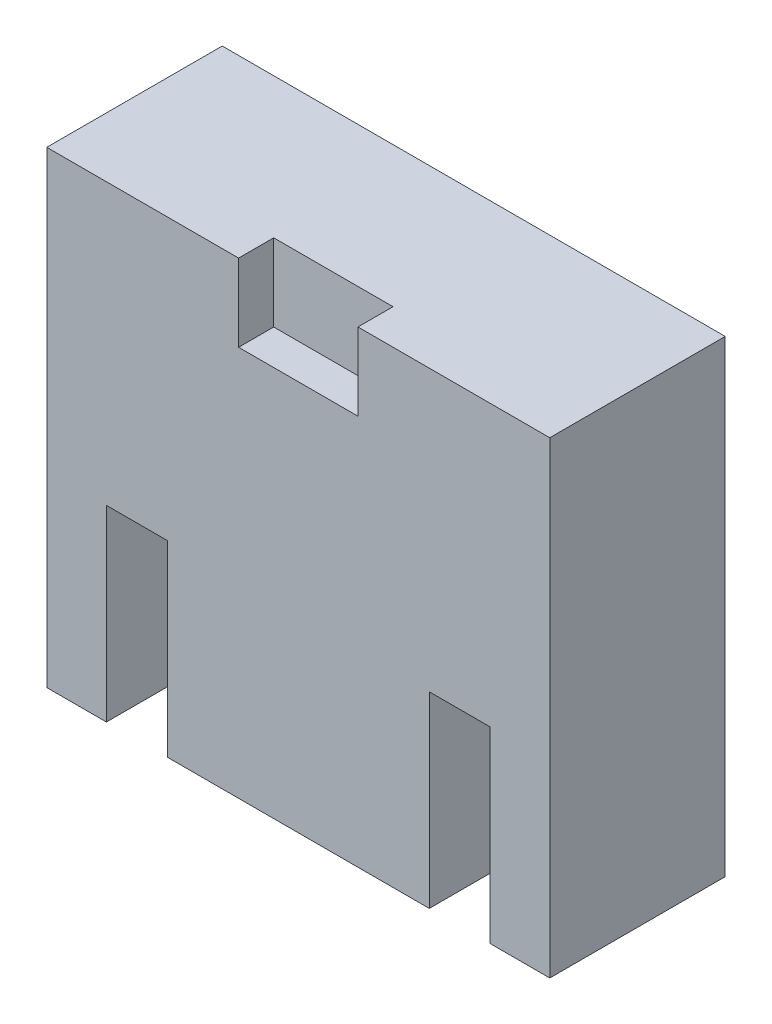
ISO-10303-21;
HEADER;
FILE_DESCRIPTION(('STEP AP214'),'2;1');
FILE_NAME('part.step','',(''),(''),'','','');
FILE_SCHEMA(('AUTOMOTIVE_DESIGN { 1 0 10303 214 1 1 1 1 }'));
ENDSEC;
DATA;
#1=APPLICATION_CONTEXT('core data for automotive mechanical design processes');
#2=APPLICATION_PROTOCOL_DEFINITION('international standard','automotive_design',2000,#1);
#3=PRODUCT_CONTEXT('',#1,'mechanical');
#4=PRODUCT('Part','Part','',(#3));
#5=PRODUCT_RELATED_PRODUCT_CATEGORY('part','',(#4));
#6=PRODUCT_DEFINITION_FORMATION('','',#4);
#7=PRODUCT_DEFINITION_CONTEXT('part definition',#1,'design');
#8=PRODUCT_DEFINITION('design','',#6,#7);
#9=PRODUCT_DEFINITION_SHAPE('','',#8);
#10=(LENGTH_UNIT() NAMED_UNIT(*) SI_UNIT(.MILLI.,.METRE.));
#11=(NAMED_UNIT(*) PLANE_ANGLE_UNIT() SI_UNIT($,.RADIAN.));
#12=(NAMED_UNIT(*) SI_UNIT($,.STERADIAN.) SOLID_ANGLE_UNIT());
#13=UNCERTAINTY_MEASURE_WITH_UNIT(LENGTH_MEASURE(1.E-05),#10,'distance_accuracy_value','');
#14=(GEOMETRIC_REPRESENTATION_CONTEXT(3) GLOBAL_UNCERTAINTY_ASSIGNED_CONTEXT((#13)) GLOBAL_UNIT_ASSIGNED_CONTEXT((#10,
#11,#12)) REPRESENTATION_CONTEXT('',''));
#15=CARTESIAN_POINT('',(0.,0.,0.));
#16=DIRECTION('',(0.,0.,1.));
#17=DIRECTION('',(1.,0.,0.));
#18=AXIS2_PLACEMENT_3D('',#15,#16,#17);
#19=CARTESIAN_POINT('',(-19.7511961722488,-18.7224880382775,15.));
#20=DIRECTION('',(0.,1.,0.));
#21=DIRECTION('',(0.,0.,1.));
#22=AXIS2_PLACEMENT_3D('',#19,#20,#21);
#23=PLANE('',#22);
#24=DIRECTION('',(0.,0.,1.));
#25=VECTOR('',#24,1.);
#26=CARTESIAN_POINT('',(-14.6511961722488,-18.7224880382775,5.));
#27=LINE('',#26,#25);
#28=CARTESIAN_POINT('',(-14.6511961722488,-18.7224880382775,5.));
#29=VERTEX_POINT('',#28);
#30=CARTESIAN_POINT('',(-14.6511961722488,-18.7224880382775,15.));
#31=VERTEX_POINT('',#30);
#32=EDGE_CURVE('E245',#29,#31,#27,.T.);
#33=ORIENTED_EDGE('',*,*,#32,.T.);
#34=DIRECTION('',(1.,0.,0.));
#35=VECTOR('',#34,1.);
#36=CARTESIAN_POINT('',(-19.7511961722488,-18.7224880382775,15.));
#37=LINE('',#36,#35);
#38=CARTESIAN_POINT('',(-19.7511961722488,-18.7224880382775,15.));
#39=VERTEX_POINT('',#38);
#40=EDGE_CURVE('E272',#39,#31,#37,.T.);
#41=ORIENTED_EDGE('',*,*,#40,.F.);
#42=DIRECTION('',(0.,0.,-1.));
#43=VECTOR('',#42,1.);
#44=CARTESIAN_POINT('',(-19.7511961722488,-18.7224880382775,15.));
#45=LINE('',#44,#43);
#46=CARTESIAN_POINT('',(-19.7511961722488,-18.7224880382775,0.));
#47=VERTEX_POINT('',#46);
#48=EDGE_CURVE('E11',#39,#47,#45,.T.);
#49=ORIENTED_EDGE('',*,*,#48,.T.);
#50=DIRECTION('',(1.,0.,0.));
#51=VECTOR('',#50,1.);
#52=CARTESIAN_POINT('',(-19.7511961722488,-18.7224880382775,0.));
#53=LINE('',#52,#51);
#54=CARTESIAN_POINT('',(23.2488038277512,-18.7224880382775,0.));
#55=VERTEX_POINT('',#54);
#56=EDGE_CURVE('E288',#47,#55,#53,.T.);
#57=ORIENTED_EDGE('',*,*,#56,.T.);
#58=DIRECTION('',(0.,0.,-1.));
#59=VECTOR('',#58,1.);
#60=CARTESIAN_POINT('',(23.2488038277512,-18.7224880382775,15.));
#61=LINE('',#60,#59);
#62=CARTESIAN_POINT('',(23.2488038277512,-18.7224880382775,15.));
#63=VERTEX_POINT('',#62);
#64=EDGE_CURVE('E48',#63,#55,#61,.T.);
#65=ORIENTED_EDGE('',*,*,#64,.F.);
#66=CARTESIAN_POINT('',(18.1488038277512,-18.7224880382775,15.));
#67=VERTEX_POINT('',#66);
#68=EDGE_CURVE('E270',#67,#63,#37,.T.);
#69=ORIENTED_EDGE('',*,*,#68,.F.);
#70=DIRECTION('',(0.,0.,1.));
#71=VECTOR('',#70,1.);
#72=CARTESIAN_POINT('',(18.1488038277512,-18.7224880382775,5.));
#73=LINE('',#72,#71);
#74=CARTESIAN_POINT('',(18.1488038277512,-18.7224880382775,5.));
#75=VERTEX_POINT('',#74);
#76=EDGE_CURVE('E55',#75,#67,#73,.T.);
#77=ORIENTED_EDGE('',*,*,#76,.F.);
#78=DIRECTION('',(1.,0.,0.));
#79=VECTOR('',#78,1.);
#80=CARTESIAN_POINT('',(0.,-18.7224880382775,5.));
#81=LINE('',#80,#79);
#82=CARTESIAN_POINT('',(12.9488038277512,-18.7224880382775,5.));
#83=VERTEX_POINT('',#82);
#84=EDGE_CURVE('E186',#83,#75,#81,.T.);
#85=ORIENTED_EDGE('',*,*,#84,.F.);
#86=DIRECTION('',(0.,0.,1.));
#87=VECTOR('',#86,1.);
#88=CARTESIAN_POINT('',(12.9488038277512,-18.7224880382775,5.));
#89=LINE('',#88,#87);
#90=CARTESIAN_POINT('',(12.9488038277512,-18.7224880382775,15.));
#91=VERTEX_POINT('',#90);
#92=EDGE_CURVE('E212',#83,#91,#89,.T.);
#93=ORIENTED_EDGE('',*,*,#92,.T.);
#94=CARTESIAN_POINT('',(-9.4511961722488,-18.7224880382775,15.));
#95=VERTEX_POINT('',#94);
#96=EDGE_CURVE('E176',#95,#91,#37,.T.);
#97=ORIENTED_EDGE('',*,*,#96,.F.);
#98=DIRECTION('',(0.,0.,1.));
#99=VECTOR('',#98,1.);
#100=CARTESIAN_POINT('',(-9.4511961722488,-18.7224880382775,5.));
#101=LINE('',#100,#99);
#102=CARTESIAN_POINT('',(-9.4511961722488,-18.7224880382775,5.));
#103=VERTEX_POINT('',#102);
#104=EDGE_CURVE('E63',#103,#95,#101,.T.);
#105=ORIENTED_EDGE('',*,*,#104,.F.);
#106=DIRECTION('',(1.,0.,0.));
#107=VECTOR('',#106,1.);
#108=CARTESIAN_POINT('',(0.,-18.7224880382775,5.));
#109=LINE('',#108,#107);
#110=EDGE_CURVE('E162',#29,#103,#109,.T.);
#111=ORIENTED_EDGE('',*,*,#110,.F.);
#112=EDGE_LOOP('',(#33,#41,#49,#57,#65,#69,#77,#85,#93,#97,#105,#111));
#113=FACE_BOUND('',#112,.T.);
#114=ADVANCED_FACE('F39',(#113),#23,.F.);
#115=CARTESIAN_POINT('',(0.,0.,15.));
#116=DIRECTION('',(0.,0.,1.));
#117=DIRECTION('',(1.,0.,0.));
#118=AXIS2_PLACEMENT_3D('',#115,#116,#117);
#119=PLANE('',#118);
#120=ORIENTED_EDGE('',*,*,#40,.T.);
#121=DIRECTION('',(0.,1.,0.));
#122=VECTOR('',#121,1.);
#123=CARTESIAN_POINT('',(-14.6511961722488,0.,15.));
#124=LINE('',#123,#122);
#125=CARTESIAN_POINT('',(-14.6511961722488,-2.68154776159317,15.));
#126=VERTEX_POINT('',#125);
#127=EDGE_CURVE('E171',#31,#126,#124,.T.);
#128=ORIENTED_EDGE('',*,*,#127,.T.);
#129=DIRECTION('',(1.,0.,0.));
#130=VECTOR('',#129,1.);
#131=CARTESIAN_POINT('',(0.,-2.68154776159317,15.));
#132=LINE('',#131,#130);
#133=CARTESIAN_POINT('',(-9.4511961722488,-2.68154776159317,15.));
#134=VERTEX_POINT('',#133);
#135=EDGE_CURVE('E341',#126,#134,#132,.T.);
#136=ORIENTED_EDGE('',*,*,#135,.T.);
#137=DIRECTION('',(0.,1.,0.));
#138=VECTOR('',#137,1.);
#139=CARTESIAN_POINT('',(-9.4511961722488,0.,15.));
#140=LINE('',#139,#138);
#141=EDGE_CURVE('E215',#95,#134,#140,.T.);
#142=ORIENTED_EDGE('',*,*,#141,.F.);
#143=ORIENTED_EDGE('',*,*,#96,.T.);
#144=DIRECTION('',(0.,1.,0.));
#145=VECTOR('',#144,1.);
#146=CARTESIAN_POINT('',(12.9488038277512,0.,15.));
#147=LINE('',#146,#145);
#148=CARTESIAN_POINT('',(12.9488038277512,-2.68154776159316,15.));
#149=VERTEX_POINT('',#148);
#150=EDGE_CURVE('E191',#91,#149,#147,.T.);
#151=ORIENTED_EDGE('',*,*,#150,.T.);
#152=DIRECTION('',(-1.,0.,0.));
#153=VECTOR('',#152,1.);
#154=CARTESIAN_POINT('',(0.,-2.68154776159316,15.));
#155=LINE('',#154,#153);
#156=CARTESIAN_POINT('',(18.1488038277512,-2.68154776159316,15.));
#157=VERTEX_POINT('',#156);
#158=EDGE_CURVE('E205',#157,#149,#155,.T.);
#159=ORIENTED_EDGE('',*,*,#158,.F.);
#160=DIRECTION('',(0.,1.,0.));
#161=VECTOR('',#160,1.);
#162=CARTESIAN_POINT('',(18.1488038277512,0.,15.));
#163=LINE('',#162,#161);
#164=EDGE_CURVE('E202',#67,#157,#163,.T.);
#165=ORIENTED_EDGE('',*,*,#164,.F.);
#166=ORIENTED_EDGE('',*,*,#68,.T.);
#167=DIRECTION('',(0.,1.,0.));
#168=VECTOR('',#167,1.);
#169=CARTESIAN_POINT('',(23.2488038277512,21.2775119617225,15.));
#170=LINE('',#169,#168);
#171=CARTESIAN_POINT('',(23.2488038277512,21.2775119617225,15.));
#172=VERTEX_POINT('',#171);
#173=EDGE_CURVE('E276',#63,#172,#170,.T.);
#174=ORIENTED_EDGE('',*,*,#173,.T.);
#175=DIRECTION('',(-1.,0.,0.));
#176=VECTOR('',#175,1.);
#177=CARTESIAN_POINT('',(-19.7511961722488,21.2775119617225,15.));
#178=LINE('',#177,#176);
#179=CARTESIAN_POINT('',(6.84880382775119,21.2775119617225,15.));
#180=VERTEX_POINT('',#179);
#181=EDGE_CURVE('E280',#172,#180,#178,.T.);
#182=ORIENTED_EDGE('',*,*,#181,.T.);
#183=DIRECTION('',(0.,-1.,0.));
#184=VECTOR('',#183,1.);
#185=CARTESIAN_POINT('',(6.84880382775119,0.,15.));
#186=LINE('',#185,#184);
#187=CARTESIAN_POINT('',(6.84880382775119,14.6721788333005,15.));
#188=VERTEX_POINT('',#187);
#189=EDGE_CURVE('E229',#180,#188,#186,.T.);
#190=ORIENTED_EDGE('',*,*,#189,.T.);
#191=DIRECTION('',(1.,0.,0.));
#192=VECTOR('',#191,1.);
#193=CARTESIAN_POINT('',(0.,14.6721788333005,15.));
#194=LINE('',#193,#192);
#195=CARTESIAN_POINT('',(-3.35119617224881,14.6721788333005,15.));
#196=VERTEX_POINT('',#195);
#197=EDGE_CURVE('E244',#196,#188,#194,.T.);
#198=ORIENTED_EDGE('',*,*,#197,.F.);
#199=DIRECTION('',(0.,-1.,0.));
#200=VECTOR('',#199,1.);
#201=CARTESIAN_POINT('',(-3.35119617224881,0.,15.));
#202=LINE('',#201,#200);
#203=CARTESIAN_POINT('',(-3.35119617224881,21.2775119617225,15.));
#204=VERTEX_POINT('',#203);
#205=EDGE_CURVE('E241',#204,#196,#202,.T.);
#206=ORIENTED_EDGE('',*,*,#205,.F.);
#207=CARTESIAN_POINT('',(-19.7511961722488,21.2775119617225,15.));
#208=VERTEX_POINT('',#207);
#209=EDGE_CURVE('E279',#204,#208,#178,.T.);
#210=ORIENTED_EDGE('',*,*,#209,.T.);
#211=DIRECTION('',(0.,-1.,0.));
#212=VECTOR('',#211,1.);
#213=CARTESIAN_POINT('',(-19.7511961722488,21.2775119617225,15.));
#214=LINE('',#213,#212);
#215=EDGE_CURVE('E266',#208,#39,#214,.T.);
#216=ORIENTED_EDGE('',*,*,#215,.T.);
#217=EDGE_LOOP('',(#120,#128,#136,#142,#143,#151,#159,#165,#166,#174,#182,#190,#198,#206,#210,#216));
#218=FACE_BOUND('',#217,.T.);
#219=ADVANCED_FACE('F324',(#218),#119,.T.);
#220=CARTESIAN_POINT('',(-19.7511961722488,21.2775119617225,15.));
#221=DIRECTION('',(1.,0.,0.));
#222=DIRECTION('',(0.,1.,0.));
#223=AXIS2_PLACEMENT_3D('',#220,#221,#222);
#224=PLANE('',#223);
#225=DIRECTION('',(0.,-1.,0.));
#226=VECTOR('',#225,1.);
#227=CARTESIAN_POINT('',(-19.7511961722488,21.2775119617225,0.));
#228=LINE('',#227,#226);
#229=CARTESIAN_POINT('',(-19.7511961722488,21.2775119617225,0.));
#230=VERTEX_POINT('',#229);
#231=EDGE_CURVE('E255',#230,#47,#228,.T.);
#232=ORIENTED_EDGE('',*,*,#231,.T.);
#233=ORIENTED_EDGE('',*,*,#48,.F.);
#234=ORIENTED_EDGE('',*,*,#215,.F.);
#235=DIRECTION('',(0.,0.,-1.));
#236=VECTOR('',#235,1.);
#237=CARTESIAN_POINT('',(-19.7511961722488,21.2775119617225,15.));
#238=LINE('',#237,#236);
#239=EDGE_CURVE('E284',#208,#230,#238,.T.);
#240=ORIENTED_EDGE('',*,*,#239,.T.);
#241=EDGE_LOOP('',(#232,#233,#234,#240));
#242=FACE_BOUND('',#241,.T.);
#243=ADVANCED_FACE('F41',(#242),#224,.F.);
#244=CARTESIAN_POINT('',(23.2488038277512,21.2775119617225,15.));
#245=DIRECTION('',(-1.,0.,0.));
#246=DIRECTION('',(0.,-1.,0.));
#247=AXIS2_PLACEMENT_3D('',#244,#245,#246);
#248=PLANE('',#247);
#249=DIRECTION('',(0.,1.,0.));
#250=VECTOR('',#249,1.);
#251=CARTESIAN_POINT('',(23.2488038277512,21.2775119617225,0.));
#252=LINE('',#251,#250);
#253=CARTESIAN_POINT('',(23.2488038277512,21.2775119617225,0.));
#254=VERTEX_POINT('',#253);
#255=EDGE_CURVE('E291',#55,#254,#252,.T.);
#256=ORIENTED_EDGE('',*,*,#255,.T.);
#257=DIRECTION('',(0.,0.,-1.));
#258=VECTOR('',#257,1.);
#259=CARTESIAN_POINT('',(23.2488038277512,21.2775119617225,15.));
#260=LINE('',#259,#258);
#261=EDGE_CURVE('E299',#172,#254,#260,.T.);
#262=ORIENTED_EDGE('',*,*,#261,.F.);
#263=ORIENTED_EDGE('',*,*,#173,.F.);
#264=ORIENTED_EDGE('',*,*,#64,.T.);
#265=EDGE_LOOP('',(#256,#262,#263,#264));
#266=FACE_BOUND('',#265,.T.);
#267=ADVANCED_FACE('F308',(#266),#248,.F.);
#268=CARTESIAN_POINT('',(-19.7511961722488,21.2775119617225,15.));
#269=DIRECTION('',(0.,-1.,0.));
#270=DIRECTION('',(0.,0.,-1.));
#271=AXIS2_PLACEMENT_3D('',#268,#269,#270);
#272=PLANE('',#271);
#273=ORIENTED_EDGE('',*,*,#209,.F.);
#274=DIRECTION('',(0.,0.,1.));
#275=VECTOR('',#274,1.);
#276=CARTESIAN_POINT('',(-3.35119617224881,21.2775119617225,12.));
#277=LINE('',#276,#275);
#278=CARTESIAN_POINT('',(-3.35119617224881,21.2775119617225,12.));
#279=VERTEX_POINT('',#278);
#280=EDGE_CURVE('E252',#279,#204,#277,.T.);
#281=ORIENTED_EDGE('',*,*,#280,.F.);
#282=DIRECTION('',(-1.,0.,0.));
#283=VECTOR('',#282,1.);
#284=CARTESIAN_POINT('',(0.,21.2775119617225,12.));
#285=LINE('',#284,#283);
#286=CARTESIAN_POINT('',(6.84880382775119,21.2775119617225,12.));
#287=VERTEX_POINT('',#286);
#288=EDGE_CURVE('E236',#287,#279,#285,.T.);
#289=ORIENTED_EDGE('',*,*,#288,.F.);
#290=DIRECTION('',(0.,0.,1.));
#291=VECTOR('',#290,1.);
#292=CARTESIAN_POINT('',(6.84880382775119,21.2775119617225,12.));
#293=LINE('',#292,#291);
#294=EDGE_CURVE('E256',#287,#180,#293,.T.);
#295=ORIENTED_EDGE('',*,*,#294,.T.);
#296=ORIENTED_EDGE('',*,*,#181,.F.);
#297=ORIENTED_EDGE('',*,*,#261,.T.);
#298=DIRECTION('',(-1.,0.,0.));
#299=VECTOR('',#298,1.);
#300=CARTESIAN_POINT('',(-19.7511961722488,21.2775119617225,0.));
#301=LINE('',#300,#299);
#302=EDGE_CURVE('E271',#254,#230,#301,.T.);
#303=ORIENTED_EDGE('',*,*,#302,.T.);
#304=ORIENTED_EDGE('',*,*,#239,.F.);
#305=EDGE_LOOP('',(#273,#281,#289,#295,#296,#297,#303,#304));
#306=FACE_BOUND('',#305,.T.);
#307=ADVANCED_FACE('F318',(#306),#272,.F.);
#308=CARTESIAN_POINT('',(0.,0.,0.));
#309=DIRECTION('',(0.,0.,1.));
#310=DIRECTION('',(1.,0.,0.));
#311=AXIS2_PLACEMENT_3D('',#308,#309,#310);
#312=PLANE('',#311);
#313=ORIENTED_EDGE('',*,*,#231,.F.);
#314=ORIENTED_EDGE('',*,*,#302,.F.);
#315=ORIENTED_EDGE('',*,*,#255,.F.);
#316=ORIENTED_EDGE('',*,*,#56,.F.);
#317=EDGE_LOOP('',(#313,#314,#315,#316));
#318=FACE_BOUND('',#317,.T.);
#319=ADVANCED_FACE('F314',(#318),#312,.F.);
#320=CARTESIAN_POINT('',(-3.35119617224881,0.,12.));
#321=DIRECTION('',(-1.,0.,0.));
#322=DIRECTION('',(0.,-1.,0.));
#323=AXIS2_PLACEMENT_3D('',#320,#321,#322);
#324=PLANE('',#323);
#325=ORIENTED_EDGE('',*,*,#205,.T.);
#326=DIRECTION('',(0.,0.,1.));
#327=VECTOR('',#326,1.);
#328=CARTESIAN_POINT('',(-3.35119617224881,14.6721788333005,12.));
#329=LINE('',#328,#327);
#330=CARTESIAN_POINT('',(-3.35119617224881,14.6721788333005,12.));
#331=VERTEX_POINT('',#330);
#332=EDGE_CURVE('E240',#331,#196,#329,.T.);
#333=ORIENTED_EDGE('',*,*,#332,.F.);
#334=DIRECTION('',(0.,-1.,0.));
#335=VECTOR('',#334,1.);
#336=CARTESIAN_POINT('',(-3.35119617224881,0.,12.));
#337=LINE('',#336,#335);
#338=EDGE_CURVE('E224',#279,#331,#337,.T.);
#339=ORIENTED_EDGE('',*,*,#338,.F.);
#340=ORIENTED_EDGE('',*,*,#280,.T.);
#341=EDGE_LOOP('',(#325,#333,#339,#340));
#342=FACE_BOUND('',#341,.T.);
#343=ADVANCED_FACE('F374',(#342),#324,.F.);
#344=CARTESIAN_POINT('',(6.84880382775119,0.,12.));
#345=DIRECTION('',(-1.,0.,0.));
#346=DIRECTION('',(0.,-1.,0.));
#347=AXIS2_PLACEMENT_3D('',#344,#345,#346);
#348=PLANE('',#347);
#349=ORIENTED_EDGE('',*,*,#189,.F.);
#350=ORIENTED_EDGE('',*,*,#294,.F.);
#351=DIRECTION('',(0.,-1.,0.));
#352=VECTOR('',#351,1.);
#353=CARTESIAN_POINT('',(6.84880382775119,0.,12.));
#354=LINE('',#353,#352);
#355=CARTESIAN_POINT('',(6.84880382775119,14.6721788333005,12.));
#356=VERTEX_POINT('',#355);
#357=EDGE_CURVE('E233',#287,#356,#354,.T.);
#358=ORIENTED_EDGE('',*,*,#357,.T.);
#359=DIRECTION('',(0.,0.,1.));
#360=VECTOR('',#359,1.);
#361=CARTESIAN_POINT('',(6.84880382775119,14.6721788333005,12.));
#362=LINE('',#361,#360);
#363=EDGE_CURVE('E260',#356,#188,#362,.T.);
#364=ORIENTED_EDGE('',*,*,#363,.T.);
#365=EDGE_LOOP('',(#349,#350,#358,#364));
#366=FACE_BOUND('',#365,.T.);
#367=ADVANCED_FACE('F378',(#366),#348,.T.);
#368=CARTESIAN_POINT('',(0.,14.6721788333005,12.));
#369=DIRECTION('',(0.,-1.,0.));
#370=DIRECTION('',(1.,0.,0.));
#371=AXIS2_PLACEMENT_3D('',#368,#369,#370);
#372=PLANE('',#371);
#373=ORIENTED_EDGE('',*,*,#197,.T.);
#374=ORIENTED_EDGE('',*,*,#363,.F.);
#375=DIRECTION('',(1.,0.,0.));
#376=VECTOR('',#375,1.);
#377=CARTESIAN_POINT('',(0.,14.6721788333005,12.));
#378=LINE('',#377,#376);
#379=EDGE_CURVE('E228',#331,#356,#378,.T.);
#380=ORIENTED_EDGE('',*,*,#379,.F.);
#381=ORIENTED_EDGE('',*,*,#332,.T.);
#382=EDGE_LOOP('',(#373,#374,#380,#381));
#383=FACE_BOUND('',#382,.T.);
#384=ADVANCED_FACE('F380',(#383),#372,.F.);
#385=CARTESIAN_POINT('',(0.,0.,12.));
#386=DIRECTION('',(0.,0.,1.));
#387=DIRECTION('',(1.,0.,0.));
#388=AXIS2_PLACEMENT_3D('',#385,#386,#387);
#389=PLANE('',#388);
#390=ORIENTED_EDGE('',*,*,#338,.T.);
#391=ORIENTED_EDGE('',*,*,#379,.T.);
#392=ORIENTED_EDGE('',*,*,#357,.F.);
#393=ORIENTED_EDGE('',*,*,#288,.T.);
#394=EDGE_LOOP('',(#390,#391,#392,#393));
#395=FACE_BOUND('',#394,.T.);
#396=ADVANCED_FACE('F383',(#395),#389,.T.);
#397=CARTESIAN_POINT('',(12.9488038277512,0.,5.));
#398=DIRECTION('',(1.,0.,0.));
#399=DIRECTION('',(0.,1.,0.));
#400=AXIS2_PLACEMENT_3D('',#397,#398,#399);
#401=PLANE('',#400);
#402=ORIENTED_EDGE('',*,*,#150,.F.);
#403=ORIENTED_EDGE('',*,*,#92,.F.);
#404=DIRECTION('',(0.,1.,0.));
#405=VECTOR('',#404,1.);
#406=CARTESIAN_POINT('',(12.9488038277512,0.,5.));
#407=LINE('',#406,#405);
#408=CARTESIAN_POINT('',(12.9488038277512,-2.68154776159316,5.));
#409=VERTEX_POINT('',#408);
#410=EDGE_CURVE('E199',#83,#409,#407,.T.);
#411=ORIENTED_EDGE('',*,*,#410,.T.);
#412=DIRECTION('',(0.,0.,1.));
#413=VECTOR('',#412,1.);
#414=CARTESIAN_POINT('',(12.9488038277512,-2.68154776159316,5.));
#415=LINE('',#414,#413);
#416=EDGE_CURVE('E216',#409,#149,#415,.T.);
#417=ORIENTED_EDGE('',*,*,#416,.T.);
#418=EDGE_LOOP('',(#402,#403,#411,#417));
#419=FACE_BOUND('',#418,.T.);
#420=ADVANCED_FACE('F390',(#419),#401,.T.);
#421=CARTESIAN_POINT('',(0.,-2.68154776159316,5.));
#422=DIRECTION('',(0.,1.,0.));
#423=DIRECTION('',(0.,0.,1.));
#424=AXIS2_PLACEMENT_3D('',#421,#422,#423);
#425=PLANE('',#424);
#426=ORIENTED_EDGE('',*,*,#158,.T.);
#427=ORIENTED_EDGE('',*,*,#416,.F.);
#428=DIRECTION('',(-1.,0.,0.));
#429=VECTOR('',#428,1.);
#430=CARTESIAN_POINT('',(0.,-2.68154776159316,5.));
#431=LINE('',#430,#429);
#432=CARTESIAN_POINT('',(18.1488038277512,-2.68154776159316,5.));
#433=VERTEX_POINT('',#432);
#434=EDGE_CURVE('E195',#433,#409,#431,.T.);
#435=ORIENTED_EDGE('',*,*,#434,.F.);
#436=DIRECTION('',(0.,0.,1.));
#437=VECTOR('',#436,1.);
#438=CARTESIAN_POINT('',(18.1488038277512,-2.68154776159316,5.));
#439=LINE('',#438,#437);
#440=EDGE_CURVE('E219',#433,#157,#439,.T.);
#441=ORIENTED_EDGE('',*,*,#440,.T.);
#442=EDGE_LOOP('',(#426,#427,#435,#441));
#443=FACE_BOUND('',#442,.T.);
#444=ADVANCED_FACE('F394',(#443),#425,.F.);
#445=CARTESIAN_POINT('',(18.1488038277512,0.,5.));
#446=DIRECTION('',(1.,0.,0.));
#447=DIRECTION('',(0.,1.,0.));
#448=AXIS2_PLACEMENT_3D('',#445,#446,#447);
#449=PLANE('',#448);
#450=ORIENTED_EDGE('',*,*,#164,.T.);
#451=ORIENTED_EDGE('',*,*,#440,.F.);
#452=DIRECTION('',(0.,1.,0.));
#453=VECTOR('',#452,1.);
#454=CARTESIAN_POINT('',(18.1488038277512,0.,5.));
#455=LINE('',#454,#453);
#456=EDGE_CURVE('E190',#75,#433,#455,.T.);
#457=ORIENTED_EDGE('',*,*,#456,.F.);
#458=ORIENTED_EDGE('',*,*,#76,.T.);
#459=EDGE_LOOP('',(#450,#451,#457,#458));
#460=FACE_BOUND('',#459,.T.);
#461=ADVANCED_FACE('F359',(#460),#449,.F.);
#462=CARTESIAN_POINT('',(0.,0.,5.));
#463=DIRECTION('',(0.,0.,1.));
#464=DIRECTION('',(1.,0.,0.));
#465=AXIS2_PLACEMENT_3D('',#462,#463,#464);
#466=PLANE('',#465);
#467=ORIENTED_EDGE('',*,*,#84,.T.);
#468=ORIENTED_EDGE('',*,*,#456,.T.);
#469=ORIENTED_EDGE('',*,*,#434,.T.);
#470=ORIENTED_EDGE('',*,*,#410,.F.);
#471=EDGE_LOOP('',(#467,#468,#469,#470));
#472=FACE_BOUND('',#471,.T.);
#473=ADVANCED_FACE('F352',(#472),#466,.T.);
#474=CARTESIAN_POINT('',(-14.6511961722488,0.,5.));
#475=DIRECTION('',(1.,0.,0.));
#476=DIRECTION('',(0.,0.,-1.));
#477=AXIS2_PLACEMENT_3D('',#474,#475,#476);
#478=PLANE('',#477);
#479=ORIENTED_EDGE('',*,*,#127,.F.);
#480=ORIENTED_EDGE('',*,*,#32,.F.);
#481=DIRECTION('',(0.,1.,0.));
#482=VECTOR('',#481,1.);
#483=CARTESIAN_POINT('',(-14.6511961722488,0.,5.));
#484=LINE('',#483,#482);
#485=CARTESIAN_POINT('',(-14.6511961722488,-2.68154776159317,5.));
#486=VERTEX_POINT('',#485);
#487=EDGE_CURVE('E167',#29,#486,#484,.T.);
#488=ORIENTED_EDGE('',*,*,#487,.T.);
#489=DIRECTION('',(0.,0.,1.));
#490=VECTOR('',#489,1.);
#491=CARTESIAN_POINT('',(-14.6511961722488,-2.68154776159317,5.));
#492=LINE('',#491,#490);
#493=EDGE_CURVE('E181',#486,#126,#492,.T.);
#494=ORIENTED_EDGE('',*,*,#493,.T.);
#495=EDGE_LOOP('',(#479,#480,#488,#494));
#496=FACE_BOUND('',#495,.T.);
#497=ADVANCED_FACE('F350',(#496),#478,.T.);
#498=CARTESIAN_POINT('',(0.,-2.68154776159317,5.));
#499=DIRECTION('',(0.,-1.,0.));
#500=DIRECTION('',(0.,0.,-1.));
#501=AXIS2_PLACEMENT_3D('',#498,#499,#500);
#502=PLANE('',#501);
#503=ORIENTED_EDGE('',*,*,#135,.F.);
#504=ORIENTED_EDGE('',*,*,#493,.F.);
#505=DIRECTION('',(1.,0.,0.));
#506=VECTOR('',#505,1.);
#507=CARTESIAN_POINT('',(0.,-2.68154776159317,5.));
#508=LINE('',#507,#506);
#509=CARTESIAN_POINT('',(-9.4511961722488,-2.68154776159317,5.));
#510=VERTEX_POINT('',#509);
#511=EDGE_CURVE('E161',#486,#510,#508,.T.);
#512=ORIENTED_EDGE('',*,*,#511,.T.);
#513=DIRECTION('',(0.,0.,1.));
#514=VECTOR('',#513,1.);
#515=CARTESIAN_POINT('',(-9.4511961722488,-2.68154776159317,5.));
#516=LINE('',#515,#514);
#517=EDGE_CURVE('E157',#510,#134,#516,.T.);
#518=ORIENTED_EDGE('',*,*,#517,.T.);
#519=EDGE_LOOP('',(#503,#504,#512,#518));
#520=FACE_BOUND('',#519,.T.);
#521=ADVANCED_FACE('F349',(#520),#502,.T.);
#522=CARTESIAN_POINT('',(-9.4511961722488,0.,5.));
#523=DIRECTION('',(1.,0.,0.));
#524=DIRECTION('',(0.,0.,-1.));
#525=AXIS2_PLACEMENT_3D('',#522,#523,#524);
#526=PLANE('',#525);
#527=ORIENTED_EDGE('',*,*,#141,.T.);
#528=ORIENTED_EDGE('',*,*,#517,.F.);
#529=DIRECTION('',(0.,1.,0.));
#530=VECTOR('',#529,1.);
#531=CARTESIAN_POINT('',(-9.4511961722488,0.,5.));
#532=LINE('',#531,#530);
#533=EDGE_CURVE('E154',#103,#510,#532,.T.);
#534=ORIENTED_EDGE('',*,*,#533,.F.);
#535=ORIENTED_EDGE('',*,*,#104,.T.);
#536=EDGE_LOOP('',(#527,#528,#534,#535));
#537=FACE_BOUND('',#536,.T.);
#538=ADVANCED_FACE('F156',(#537),#526,.F.);
#539=CARTESIAN_POINT('',(0.,0.,5.));
#540=DIRECTION('',(0.,0.,1.));
#541=DIRECTION('',(1.,0.,0.));
#542=AXIS2_PLACEMENT_3D('',#539,#540,#541);
#543=PLANE('',#542);
#544=ORIENTED_EDGE('',*,*,#110,.T.);
#545=ORIENTED_EDGE('',*,*,#533,.T.);
#546=ORIENTED_EDGE('',*,*,#511,.F.);
#547=ORIENTED_EDGE('',*,*,#487,.F.);
#548=EDGE_LOOP('',(#544,#545,#546,#547));
#549=FACE_BOUND('',#548,.T.);
#550=ADVANCED_FACE('F166',(#549),#543,.T.);
#551=CLOSED_SHELL('',(#114,#219,#243,#267,#307,#319,#343,#367,#384,#396,#420,#444,#461,#473,
#497,#521,#538,#550));
#552=MANIFOLD_SOLID_BREP('B2',#551);
#553=ADVANCED_BREP_SHAPE_REPRESENTATION('',(#18,#552),#14);
#554=SHAPE_DEFINITION_REPRESENTATION(#9,#553);
ENDSEC;
END-ISO-10303-21;
